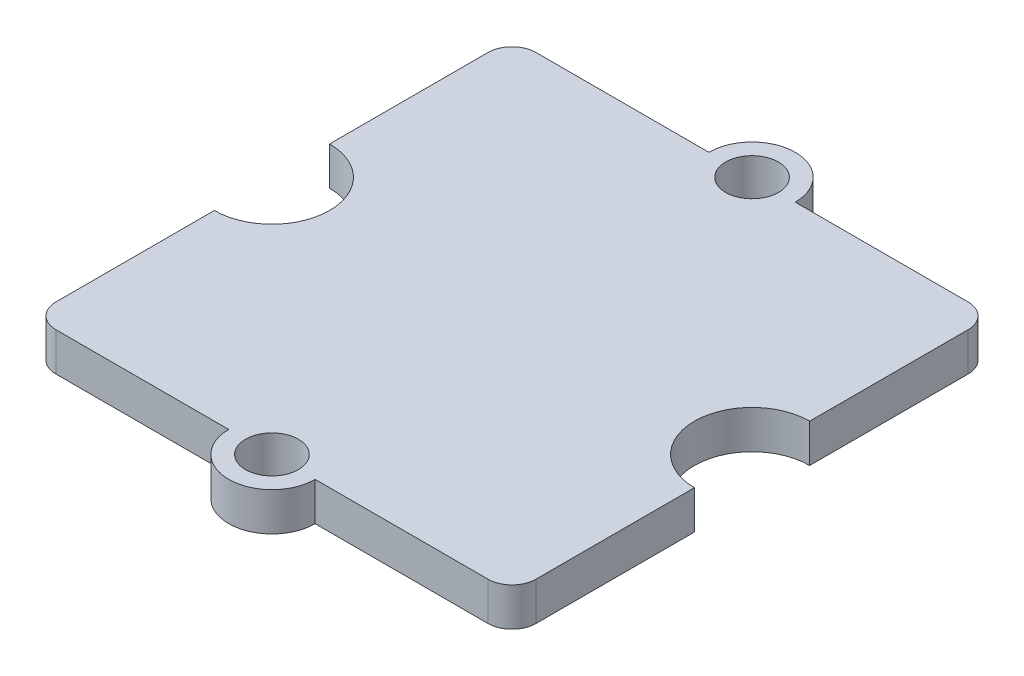
ISO-10303-21;
HEADER;
FILE_DESCRIPTION(('STEP AP214'),'2;1');
FILE_NAME('part.step','',(''),(''),'','','');
FILE_SCHEMA(('AUTOMOTIVE_DESIGN { 1 0 10303 214 1 1 1 1 }'));
ENDSEC;
DATA;
#1=APPLICATION_CONTEXT('core data for automotive mechanical design processes');
#2=APPLICATION_PROTOCOL_DEFINITION('international standard','automotive_design',2000,#1);
#3=PRODUCT_CONTEXT('',#1,'mechanical');
#4=PRODUCT('Part','Part','',(#3));
#5=PRODUCT_RELATED_PRODUCT_CATEGORY('part','',(#4));
#6=PRODUCT_DEFINITION_FORMATION('','',#4);
#7=PRODUCT_DEFINITION_CONTEXT('part definition',#1,'design');
#8=PRODUCT_DEFINITION('design','',#6,#7);
#9=PRODUCT_DEFINITION_SHAPE('','',#8);
#10=(LENGTH_UNIT() NAMED_UNIT(*) SI_UNIT(.MILLI.,.METRE.));
#11=(NAMED_UNIT(*) PLANE_ANGLE_UNIT() SI_UNIT($,.RADIAN.));
#12=(NAMED_UNIT(*) SI_UNIT($,.STERADIAN.) SOLID_ANGLE_UNIT());
#13=UNCERTAINTY_MEASURE_WITH_UNIT(LENGTH_MEASURE(1.E-05),#10,'distance_accuracy_value','');
#14=(GEOMETRIC_REPRESENTATION_CONTEXT(3) GLOBAL_UNCERTAINTY_ASSIGNED_CONTEXT((#13)) GLOBAL_UNIT_ASSIGNED_CONTEXT((#10,
#11,#12)) REPRESENTATION_CONTEXT('',''));
#15=CARTESIAN_POINT('',(0.,0.,0.));
#16=DIRECTION('',(0.,0.,1.));
#17=DIRECTION('',(1.,0.,0.));
#18=AXIS2_PLACEMENT_3D('',#15,#16,#17);
#19=CARTESIAN_POINT('',(0.,1.6,10.));
#20=DIRECTION('',(0.,-1.,0.));
#21=DIRECTION('',(0.,0.,-1.));
#22=AXIS2_PLACEMENT_3D('',#19,#20,#21);
#23=CYLINDRICAL_SURFACE('',#22,1.8);
#24=CARTESIAN_POINT('',(0.,0.,10.));
#25=DIRECTION('',(0.,1.,0.));
#26=DIRECTION('',(0.,0.,1.));
#27=AXIS2_PLACEMENT_3D('',#24,#25,#26);
#28=CIRCLE('',#27,1.8);
#29=CARTESIAN_POINT('',(-1.8,0.,10.));
#30=VERTEX_POINT('',#29);
#31=CARTESIAN_POINT('',(1.8,0.,10.));
#32=VERTEX_POINT('',#31);
#33=EDGE_CURVE('E185',#30,#32,#28,.T.);
#34=ORIENTED_EDGE('',*,*,#33,.T.);
#35=DIRECTION('',(0.,-1.,0.));
#36=VECTOR('',#35,1.);
#37=CARTESIAN_POINT('',(1.8,1.6,10.));
#38=LINE('',#37,#36);
#39=CARTESIAN_POINT('',(1.8,1.6,10.));
#40=VERTEX_POINT('',#39);
#41=EDGE_CURVE('E11',#40,#32,#38,.T.);
#42=ORIENTED_EDGE('',*,*,#41,.F.);
#43=CARTESIAN_POINT('',(0.,1.6,10.));
#44=DIRECTION('',(0.,1.,0.));
#45=DIRECTION('',(0.,0.,1.));
#46=AXIS2_PLACEMENT_3D('',#43,#44,#45);
#47=CIRCLE('',#46,1.8);
#48=CARTESIAN_POINT('',(-1.8,1.6,10.));
#49=VERTEX_POINT('',#48);
#50=EDGE_CURVE('E226',#49,#40,#47,.T.);
#51=ORIENTED_EDGE('',*,*,#50,.F.);
#52=DIRECTION('',(0.,-1.,0.));
#53=VECTOR('',#52,1.);
#54=CARTESIAN_POINT('',(-1.8,1.6,10.));
#55=LINE('',#54,#53);
#56=EDGE_CURVE('E184',#49,#30,#55,.T.);
#57=ORIENTED_EDGE('',*,*,#56,.T.);
#58=EDGE_LOOP('',(#34,#42,#51,#57));
#59=FACE_BOUND('',#58,.T.);
#60=ADVANCED_FACE('F34',(#59),#23,.T.);
#61=CARTESIAN_POINT('',(0.,1.6,10.));
#62=DIRECTION('',(0.,0.,-1.));
#63=DIRECTION('',(-1.,0.,0.));
#64=AXIS2_PLACEMENT_3D('',#61,#62,#63);
#65=PLANE('',#64);
#66=DIRECTION('',(1.,0.,0.));
#67=VECTOR('',#66,1.);
#68=CARTESIAN_POINT('',(0.,0.,10.));
#69=LINE('',#68,#67);
#70=CARTESIAN_POINT('',(8.99999999999999,0.,10.));
#71=VERTEX_POINT('',#70);
#72=EDGE_CURVE('E188',#32,#71,#69,.T.);
#73=ORIENTED_EDGE('',*,*,#72,.T.);
#74=DIRECTION('',(0.,-1.,0.));
#75=VECTOR('',#74,1.);
#76=CARTESIAN_POINT('',(8.99999999999999,1.6,10.));
#77=LINE('',#76,#75);
#78=CARTESIAN_POINT('',(8.99999999999999,1.6,10.));
#79=VERTEX_POINT('',#78);
#80=EDGE_CURVE('E42',#79,#71,#77,.T.);
#81=ORIENTED_EDGE('',*,*,#80,.F.);
#82=DIRECTION('',(1.,0.,0.));
#83=VECTOR('',#82,1.);
#84=CARTESIAN_POINT('',(0.,1.6,10.));
#85=LINE('',#84,#83);
#86=EDGE_CURVE('E113',#40,#79,#85,.T.);
#87=ORIENTED_EDGE('',*,*,#86,.F.);
#88=ORIENTED_EDGE('',*,*,#41,.T.);
#89=EDGE_LOOP('',(#73,#81,#87,#88));
#90=FACE_BOUND('',#89,.T.);
#91=ADVANCED_FACE('F306',(#90),#65,.F.);
#92=CARTESIAN_POINT('',(9.,1.6,9.00000000000001));
#93=DIRECTION('',(0.,-1.,0.));
#94=DIRECTION('',(0.,0.,-1.));
#95=AXIS2_PLACEMENT_3D('',#92,#93,#94);
#96=CYLINDRICAL_SURFACE('',#95,1.);
#97=CARTESIAN_POINT('',(9.,0.,9.00000000000001));
#98=DIRECTION('',(0.,1.,0.));
#99=DIRECTION('',(0.,0.,1.));
#100=AXIS2_PLACEMENT_3D('',#97,#98,#99);
#101=CIRCLE('',#100,1.);
#102=CARTESIAN_POINT('',(10.,0.,9.));
#103=VERTEX_POINT('',#102);
#104=EDGE_CURVE('E190',#71,#103,#101,.T.);
#105=ORIENTED_EDGE('',*,*,#104,.T.);
#106=DIRECTION('',(0.,-1.,0.));
#107=VECTOR('',#106,1.);
#108=CARTESIAN_POINT('',(10.,1.6,9.));
#109=LINE('',#108,#107);
#110=CARTESIAN_POINT('',(10.,1.6,9.));
#111=VERTEX_POINT('',#110);
#112=EDGE_CURVE('E248',#111,#103,#109,.T.);
#113=ORIENTED_EDGE('',*,*,#112,.F.);
#114=CARTESIAN_POINT('',(9.,1.6,9.00000000000001));
#115=DIRECTION('',(0.,1.,0.));
#116=DIRECTION('',(0.,0.,1.));
#117=AXIS2_PLACEMENT_3D('',#114,#115,#116);
#118=CIRCLE('',#117,1.);
#119=EDGE_CURVE('E256',#79,#111,#118,.T.);
#120=ORIENTED_EDGE('',*,*,#119,.F.);
#121=ORIENTED_EDGE('',*,*,#80,.T.);
#122=EDGE_LOOP('',(#105,#113,#120,#121));
#123=FACE_BOUND('',#122,.T.);
#124=ADVANCED_FACE('F254',(#123),#96,.T.);
#125=CARTESIAN_POINT('',(10.,1.6,0.));
#126=DIRECTION('',(-1.,0.,0.));
#127=DIRECTION('',(0.,0.,1.));
#128=AXIS2_PLACEMENT_3D('',#125,#126,#127);
#129=PLANE('',#128);
#130=DIRECTION('',(0.,0.,-1.));
#131=VECTOR('',#130,1.);
#132=CARTESIAN_POINT('',(10.,0.,0.));
#133=LINE('',#132,#131);
#134=CARTESIAN_POINT('',(10.,0.,2.40000000000001));
#135=VERTEX_POINT('',#134);
#136=EDGE_CURVE('E192',#103,#135,#133,.T.);
#137=ORIENTED_EDGE('',*,*,#136,.T.);
#138=DIRECTION('',(0.,-1.,0.));
#139=VECTOR('',#138,1.);
#140=CARTESIAN_POINT('',(10.,1.6,2.40000000000001));
#141=LINE('',#140,#139);
#142=CARTESIAN_POINT('',(10.,1.6,2.40000000000001));
#143=VERTEX_POINT('',#142);
#144=EDGE_CURVE('E246',#143,#135,#141,.T.);
#145=ORIENTED_EDGE('',*,*,#144,.F.);
#146=DIRECTION('',(0.,0.,-1.));
#147=VECTOR('',#146,1.);
#148=CARTESIAN_POINT('',(10.,1.6,0.));
#149=LINE('',#148,#147);
#150=EDGE_CURVE('E269',#111,#143,#149,.T.);
#151=ORIENTED_EDGE('',*,*,#150,.F.);
#152=ORIENTED_EDGE('',*,*,#112,.T.);
#153=EDGE_LOOP('',(#137,#145,#151,#152));
#154=FACE_BOUND('',#153,.T.);
#155=ADVANCED_FACE('F266',(#154),#129,.F.);
#156=CARTESIAN_POINT('',(10.,1.6,0.));
#157=DIRECTION('',(0.,-1.,0.));
#158=DIRECTION('',(0.,0.,-1.));
#159=AXIS2_PLACEMENT_3D('',#156,#157,#158);
#160=CYLINDRICAL_SURFACE('',#159,2.4);
#161=CARTESIAN_POINT('',(10.,0.,0.));
#162=DIRECTION('',(0.,1.,0.));
#163=DIRECTION('',(0.,0.,1.));
#164=AXIS2_PLACEMENT_3D('',#161,#162,#163);
#165=CIRCLE('',#164,2.4);
#166=CARTESIAN_POINT('',(10.,0.,-2.39999999999999));
#167=VERTEX_POINT('',#166);
#168=EDGE_CURVE('E195',#167,#135,#165,.T.);
#169=ORIENTED_EDGE('',*,*,#168,.F.);
#170=DIRECTION('',(0.,-1.,0.));
#171=VECTOR('',#170,1.);
#172=CARTESIAN_POINT('',(10.,1.6,-2.39999999999999));
#173=LINE('',#172,#171);
#174=CARTESIAN_POINT('',(10.,1.6,-2.39999999999999));
#175=VERTEX_POINT('',#174);
#176=EDGE_CURVE('E244',#175,#167,#173,.T.);
#177=ORIENTED_EDGE('',*,*,#176,.F.);
#178=CARTESIAN_POINT('',(10.,1.6,0.));
#179=DIRECTION('',(0.,1.,0.));
#180=DIRECTION('',(0.,0.,1.));
#181=AXIS2_PLACEMENT_3D('',#178,#179,#180);
#182=CIRCLE('',#181,2.4);
#183=EDGE_CURVE('E271',#175,#143,#182,.T.);
#184=ORIENTED_EDGE('',*,*,#183,.T.);
#185=ORIENTED_EDGE('',*,*,#144,.T.);
#186=EDGE_LOOP('',(#169,#177,#184,#185));
#187=FACE_BOUND('',#186,.T.);
#188=ADVANCED_FACE('F335',(#187),#160,.F.);
#189=CARTESIAN_POINT('',(10.,0.,-8.99999999999999));
#190=VERTEX_POINT('',#189);
#191=EDGE_CURVE('E196',#167,#190,#133,.T.);
#192=ORIENTED_EDGE('',*,*,#191,.T.);
#193=DIRECTION('',(0.,-1.,0.));
#194=VECTOR('',#193,1.);
#195=CARTESIAN_POINT('',(10.,1.6,-8.99999999999999));
#196=LINE('',#195,#194);
#197=CARTESIAN_POINT('',(10.,1.6,-8.99999999999999));
#198=VERTEX_POINT('',#197);
#199=EDGE_CURVE('E242',#198,#190,#196,.T.);
#200=ORIENTED_EDGE('',*,*,#199,.F.);
#201=EDGE_CURVE('E273',#175,#198,#149,.T.);
#202=ORIENTED_EDGE('',*,*,#201,.F.);
#203=ORIENTED_EDGE('',*,*,#176,.T.);
#204=EDGE_LOOP('',(#192,#200,#202,#203));
#205=FACE_BOUND('',#204,.T.);
#206=ADVANCED_FACE('F337',(#205),#129,.F.);
#207=CARTESIAN_POINT('',(9.,1.6,-8.99999999999999));
#208=DIRECTION('',(0.,-1.,0.));
#209=DIRECTION('',(0.,0.,-1.));
#210=AXIS2_PLACEMENT_3D('',#207,#208,#209);
#211=CYLINDRICAL_SURFACE('',#210,1.);
#212=CARTESIAN_POINT('',(9.,0.,-8.99999999999999));
#213=DIRECTION('',(0.,1.,0.));
#214=DIRECTION('',(0.,0.,1.));
#215=AXIS2_PLACEMENT_3D('',#212,#213,#214);
#216=CIRCLE('',#215,1.);
#217=CARTESIAN_POINT('',(8.99999999999999,0.,-9.99999999999999));
#218=VERTEX_POINT('',#217);
#219=EDGE_CURVE('E199',#218,#190,#216,.F.);
#220=ORIENTED_EDGE('',*,*,#219,.F.);
#221=DIRECTION('',(0.,-1.,0.));
#222=VECTOR('',#221,1.);
#223=CARTESIAN_POINT('',(8.99999999999999,1.6,-9.99999999999999));
#224=LINE('',#223,#222);
#225=CARTESIAN_POINT('',(8.99999999999999,1.6,-9.99999999999999));
#226=VERTEX_POINT('',#225);
#227=EDGE_CURVE('E240',#226,#218,#224,.T.);
#228=ORIENTED_EDGE('',*,*,#227,.F.);
#229=CARTESIAN_POINT('',(9.,1.6,-8.99999999999999));
#230=DIRECTION('',(0.,1.,0.));
#231=DIRECTION('',(0.,0.,1.));
#232=AXIS2_PLACEMENT_3D('',#229,#230,#231);
#233=CIRCLE('',#232,1.);
#234=EDGE_CURVE('E276',#226,#198,#233,.F.);
#235=ORIENTED_EDGE('',*,*,#234,.T.);
#236=ORIENTED_EDGE('',*,*,#199,.T.);
#237=EDGE_LOOP('',(#220,#228,#235,#236));
#238=FACE_BOUND('',#237,.T.);
#239=ADVANCED_FACE('F350',(#238),#211,.T.);
#240=CARTESIAN_POINT('',(0.,1.6,-9.99999999999999));
#241=DIRECTION('',(0.,0.,-1.));
#242=DIRECTION('',(-1.,0.,0.));
#243=AXIS2_PLACEMENT_3D('',#240,#241,#242);
#244=PLANE('',#243);
#245=DIRECTION('',(1.,0.,0.));
#246=VECTOR('',#245,1.);
#247=CARTESIAN_POINT('',(0.,0.,-9.99999999999999));
#248=LINE('',#247,#246);
#249=CARTESIAN_POINT('',(1.8,0.,-9.99999999999999));
#250=VERTEX_POINT('',#249);
#251=EDGE_CURVE('E202',#250,#218,#248,.T.);
#252=ORIENTED_EDGE('',*,*,#251,.F.);
#253=DIRECTION('',(0.,-1.,0.));
#254=VECTOR('',#253,1.);
#255=CARTESIAN_POINT('',(1.8,1.6,-9.99999999999999));
#256=LINE('',#255,#254);
#257=CARTESIAN_POINT('',(1.8,1.6,-9.99999999999999));
#258=VERTEX_POINT('',#257);
#259=EDGE_CURVE('E238',#258,#250,#256,.T.);
#260=ORIENTED_EDGE('',*,*,#259,.F.);
#261=DIRECTION('',(1.,0.,0.));
#262=VECTOR('',#261,1.);
#263=CARTESIAN_POINT('',(0.,1.6,-9.99999999999999));
#264=LINE('',#263,#262);
#265=EDGE_CURVE('E281',#258,#226,#264,.T.);
#266=ORIENTED_EDGE('',*,*,#265,.T.);
#267=ORIENTED_EDGE('',*,*,#227,.T.);
#268=EDGE_LOOP('',(#252,#260,#266,#267));
#269=FACE_BOUND('',#268,.T.);
#270=ADVANCED_FACE('F357',(#269),#244,.T.);
#271=CARTESIAN_POINT('',(0.,1.6,-9.99999999999999));
#272=DIRECTION('',(0.,-1.,0.));
#273=DIRECTION('',(0.,0.,-1.));
#274=AXIS2_PLACEMENT_3D('',#271,#272,#273);
#275=CYLINDRICAL_SURFACE('',#274,1.8);
#276=CARTESIAN_POINT('',(0.,0.,-9.99999999999999));
#277=DIRECTION('',(0.,1.,0.));
#278=DIRECTION('',(0.,0.,1.));
#279=AXIS2_PLACEMENT_3D('',#276,#277,#278);
#280=CIRCLE('',#279,1.8);
#281=CARTESIAN_POINT('',(-1.8,0.,-9.99999999999999));
#282=VERTEX_POINT('',#281);
#283=EDGE_CURVE('E205',#250,#282,#280,.T.);
#284=ORIENTED_EDGE('',*,*,#283,.T.);
#285=DIRECTION('',(0.,-1.,0.));
#286=VECTOR('',#285,1.);
#287=CARTESIAN_POINT('',(-1.8,1.6,-9.99999999999999));
#288=LINE('',#287,#286);
#289=CARTESIAN_POINT('',(-1.8,1.6,-9.99999999999999));
#290=VERTEX_POINT('',#289);
#291=EDGE_CURVE('E236',#290,#282,#288,.T.);
#292=ORIENTED_EDGE('',*,*,#291,.F.);
#293=CARTESIAN_POINT('',(0.,1.6,-9.99999999999999));
#294=DIRECTION('',(0.,1.,0.));
#295=DIRECTION('',(0.,0.,1.));
#296=AXIS2_PLACEMENT_3D('',#293,#294,#295);
#297=CIRCLE('',#296,1.8);
#298=EDGE_CURVE('E285',#258,#290,#297,.T.);
#299=ORIENTED_EDGE('',*,*,#298,.F.);
#300=ORIENTED_EDGE('',*,*,#259,.T.);
#301=EDGE_LOOP('',(#284,#292,#299,#300));
#302=FACE_BOUND('',#301,.T.);
#303=ADVANCED_FACE('F364',(#302),#275,.T.);
#304=CARTESIAN_POINT('',(-8.99999999999999,0.,-9.99999999999999));
#305=VERTEX_POINT('',#304);
#306=EDGE_CURVE('E206',#305,#282,#248,.T.);
#307=ORIENTED_EDGE('',*,*,#306,.F.);
#308=DIRECTION('',(0.,-1.,0.));
#309=VECTOR('',#308,1.);
#310=CARTESIAN_POINT('',(-8.99999999999999,1.6,-9.99999999999999));
#311=LINE('',#310,#309);
#312=CARTESIAN_POINT('',(-8.99999999999999,1.6,-9.99999999999999));
#313=VERTEX_POINT('',#312);
#314=EDGE_CURVE('E234',#313,#305,#311,.T.);
#315=ORIENTED_EDGE('',*,*,#314,.F.);
#316=EDGE_CURVE('E287',#313,#290,#264,.T.);
#317=ORIENTED_EDGE('',*,*,#316,.T.);
#318=ORIENTED_EDGE('',*,*,#291,.T.);
#319=EDGE_LOOP('',(#307,#315,#317,#318));
#320=FACE_BOUND('',#319,.T.);
#321=ADVANCED_FACE('F367',(#320),#244,.T.);
#322=CARTESIAN_POINT('',(-9.,1.6,-8.99999999999999));
#323=DIRECTION('',(0.,-1.,0.));
#324=DIRECTION('',(0.,0.,-1.));
#325=AXIS2_PLACEMENT_3D('',#322,#323,#324);
#326=CYLINDRICAL_SURFACE('',#325,1.);
#327=CARTESIAN_POINT('',(-9.,0.,-8.99999999999999));
#328=DIRECTION('',(0.,1.,0.));
#329=DIRECTION('',(0.,0.,1.));
#330=AXIS2_PLACEMENT_3D('',#327,#328,#329);
#331=CIRCLE('',#330,1.);
#332=CARTESIAN_POINT('',(-10.,0.,-8.99999999999999));
#333=VERTEX_POINT('',#332);
#334=EDGE_CURVE('E209',#333,#305,#331,.F.);
#335=ORIENTED_EDGE('',*,*,#334,.F.);
#336=DIRECTION('',(0.,-1.,0.));
#337=VECTOR('',#336,1.);
#338=CARTESIAN_POINT('',(-10.,1.6,-8.99999999999999));
#339=LINE('',#338,#337);
#340=CARTESIAN_POINT('',(-10.,1.6,-8.99999999999999));
#341=VERTEX_POINT('',#340);
#342=EDGE_CURVE('E232',#341,#333,#339,.T.);
#343=ORIENTED_EDGE('',*,*,#342,.F.);
#344=CARTESIAN_POINT('',(-9.,1.6,-8.99999999999999));
#345=DIRECTION('',(0.,1.,0.));
#346=DIRECTION('',(0.,0.,1.));
#347=AXIS2_PLACEMENT_3D('',#344,#345,#346);
#348=CIRCLE('',#347,1.);
#349=EDGE_CURVE('E290',#341,#313,#348,.F.);
#350=ORIENTED_EDGE('',*,*,#349,.T.);
#351=ORIENTED_EDGE('',*,*,#314,.T.);
#352=EDGE_LOOP('',(#335,#343,#350,#351));
#353=FACE_BOUND('',#352,.T.);
#354=ADVANCED_FACE('F380',(#353),#326,.T.);
#355=CARTESIAN_POINT('',(-10.,1.6,0.));
#356=DIRECTION('',(-1.,0.,0.));
#357=DIRECTION('',(0.,0.,1.));
#358=AXIS2_PLACEMENT_3D('',#355,#356,#357);
#359=PLANE('',#358);
#360=DIRECTION('',(0.,0.,-1.));
#361=VECTOR('',#360,1.);
#362=CARTESIAN_POINT('',(-10.,0.,0.));
#363=LINE('',#362,#361);
#364=CARTESIAN_POINT('',(-10.,0.,-2.39999999999999));
#365=VERTEX_POINT('',#364);
#366=EDGE_CURVE('E212',#365,#333,#363,.T.);
#367=ORIENTED_EDGE('',*,*,#366,.F.);
#368=DIRECTION('',(0.,-1.,0.));
#369=VECTOR('',#368,1.);
#370=CARTESIAN_POINT('',(-10.,1.6,-2.39999999999999));
#371=LINE('',#370,#369);
#372=CARTESIAN_POINT('',(-10.,1.6,-2.39999999999999));
#373=VERTEX_POINT('',#372);
#374=EDGE_CURVE('E230',#373,#365,#371,.T.);
#375=ORIENTED_EDGE('',*,*,#374,.F.);
#376=DIRECTION('',(0.,0.,-1.));
#377=VECTOR('',#376,1.);
#378=CARTESIAN_POINT('',(-10.,1.6,0.));
#379=LINE('',#378,#377);
#380=EDGE_CURVE('E172',#373,#341,#379,.T.);
#381=ORIENTED_EDGE('',*,*,#380,.T.);
#382=ORIENTED_EDGE('',*,*,#342,.T.);
#383=EDGE_LOOP('',(#367,#375,#381,#382));
#384=FACE_BOUND('',#383,.T.);
#385=ADVANCED_FACE('F387',(#384),#359,.T.);
#386=CARTESIAN_POINT('',(-10.,1.6,0.));
#387=DIRECTION('',(0.,-1.,0.));
#388=DIRECTION('',(0.,0.,-1.));
#389=AXIS2_PLACEMENT_3D('',#386,#387,#388);
#390=CYLINDRICAL_SURFACE('',#389,2.4);
#391=CARTESIAN_POINT('',(-10.,0.,0.));
#392=DIRECTION('',(0.,1.,0.));
#393=DIRECTION('',(0.,0.,1.));
#394=AXIS2_PLACEMENT_3D('',#391,#392,#393);
#395=CIRCLE('',#394,2.4);
#396=CARTESIAN_POINT('',(-10.,0.,2.40000000000001));
#397=VERTEX_POINT('',#396);
#398=EDGE_CURVE('E215',#397,#365,#395,.T.);
#399=ORIENTED_EDGE('',*,*,#398,.F.);
#400=DIRECTION('',(0.,-1.,0.));
#401=VECTOR('',#400,1.);
#402=CARTESIAN_POINT('',(-10.,1.6,2.40000000000001));
#403=LINE('',#402,#401);
#404=CARTESIAN_POINT('',(-10.,1.6,2.40000000000001));
#405=VERTEX_POINT('',#404);
#406=EDGE_CURVE('E162',#405,#397,#403,.T.);
#407=ORIENTED_EDGE('',*,*,#406,.F.);
#408=CARTESIAN_POINT('',(-10.,1.6,0.));
#409=DIRECTION('',(0.,1.,0.));
#410=DIRECTION('',(0.,0.,1.));
#411=AXIS2_PLACEMENT_3D('',#408,#409,#410);
#412=CIRCLE('',#411,2.4);
#413=EDGE_CURVE('E170',#405,#373,#412,.T.);
#414=ORIENTED_EDGE('',*,*,#413,.T.);
#415=ORIENTED_EDGE('',*,*,#374,.T.);
#416=EDGE_LOOP('',(#399,#407,#414,#415));
#417=FACE_BOUND('',#416,.T.);
#418=ADVANCED_FACE('F296',(#417),#390,.F.);
#419=CARTESIAN_POINT('',(-10.,0.,9.));
#420=VERTEX_POINT('',#419);
#421=EDGE_CURVE('E157',#420,#397,#363,.T.);
#422=ORIENTED_EDGE('',*,*,#421,.F.);
#423=DIRECTION('',(0.,-1.,0.));
#424=VECTOR('',#423,1.);
#425=CARTESIAN_POINT('',(-10.,1.6,9.));
#426=LINE('',#425,#424);
#427=CARTESIAN_POINT('',(-10.,1.6,9.));
#428=VERTEX_POINT('',#427);
#429=EDGE_CURVE('E152',#428,#420,#426,.T.);
#430=ORIENTED_EDGE('',*,*,#429,.F.);
#431=EDGE_CURVE('E155',#428,#405,#379,.T.);
#432=ORIENTED_EDGE('',*,*,#431,.T.);
#433=ORIENTED_EDGE('',*,*,#406,.T.);
#434=EDGE_LOOP('',(#422,#430,#432,#433));
#435=FACE_BOUND('',#434,.T.);
#436=ADVANCED_FACE('F154',(#435),#359,.T.);
#437=CARTESIAN_POINT('',(-9.,1.6,9.00000000000001));
#438=DIRECTION('',(0.,-1.,0.));
#439=DIRECTION('',(0.,0.,-1.));
#440=AXIS2_PLACEMENT_3D('',#437,#438,#439);
#441=CYLINDRICAL_SURFACE('',#440,1.);
#442=CARTESIAN_POINT('',(-9.,0.,9.00000000000001));
#443=DIRECTION('',(0.,1.,0.));
#444=DIRECTION('',(0.,0.,1.));
#445=AXIS2_PLACEMENT_3D('',#442,#443,#444);
#446=CIRCLE('',#445,1.);
#447=CARTESIAN_POINT('',(-8.99999999999999,0.,10.));
#448=VERTEX_POINT('',#447);
#449=EDGE_CURVE('E218',#448,#420,#446,.F.);
#450=ORIENTED_EDGE('',*,*,#449,.F.);
#451=DIRECTION('',(0.,-1.,0.));
#452=VECTOR('',#451,1.);
#453=CARTESIAN_POINT('',(-8.99999999999999,1.6,10.));
#454=LINE('',#453,#452);
#455=CARTESIAN_POINT('',(-8.99999999999999,1.6,10.));
#456=VERTEX_POINT('',#455);
#457=EDGE_CURVE('E102',#456,#448,#454,.T.);
#458=ORIENTED_EDGE('',*,*,#457,.F.);
#459=CARTESIAN_POINT('',(-9.,1.6,9.00000000000001));
#460=DIRECTION('',(0.,1.,0.));
#461=DIRECTION('',(0.,0.,1.));
#462=AXIS2_PLACEMENT_3D('',#459,#460,#461);
#463=CIRCLE('',#462,1.);
#464=EDGE_CURVE('E167',#456,#428,#463,.F.);
#465=ORIENTED_EDGE('',*,*,#464,.T.);
#466=ORIENTED_EDGE('',*,*,#429,.T.);
#467=EDGE_LOOP('',(#450,#458,#465,#466));
#468=FACE_BOUND('',#467,.T.);
#469=ADVANCED_FACE('F173',(#468),#441,.T.);
#470=CARTESIAN_POINT('',(0.,1.6,-9.99999999999999));
#471=DIRECTION('',(0.,-1.,0.));
#472=DIRECTION('',(0.,0.,-1.));
#473=AXIS2_PLACEMENT_3D('',#470,#471,#472);
#474=CYLINDRICAL_SURFACE('',#473,1.1);
#475=CARTESIAN_POINT('',(0.,1.6,-9.99999999999999));
#476=DIRECTION('',(0.,1.,0.));
#477=DIRECTION('',(0.,0.,1.));
#478=AXIS2_PLACEMENT_3D('',#475,#476,#477);
#479=CIRCLE('',#478,1.1);
#480=CARTESIAN_POINT('',(0.,1.6,-8.9));
#481=VERTEX_POINT('',#480);
#482=EDGE_CURVE('E175',#481,#481,#479,.T.);
#483=ORIENTED_EDGE('',*,*,#482,.T.);
#484=EDGE_LOOP('',(#483));
#485=FACE_BOUND('',#484,.T.);
#486=CARTESIAN_POINT('',(0.,0.,-9.99999999999999));
#487=DIRECTION('',(0.,1.,0.));
#488=DIRECTION('',(0.,0.,1.));
#489=AXIS2_PLACEMENT_3D('',#486,#487,#488);
#490=CIRCLE('',#489,1.1);
#491=CARTESIAN_POINT('',(0.,0.,-8.9));
#492=VERTEX_POINT('',#491);
#493=EDGE_CURVE('E220',#492,#492,#490,.T.);
#494=ORIENTED_EDGE('',*,*,#493,.F.);
#495=EDGE_LOOP('',(#494));
#496=FACE_BOUND('',#495,.T.);
#497=ADVANCED_FACE('F304',(#485,#496),#474,.F.);
#498=EDGE_CURVE('E105',#448,#30,#69,.T.);
#499=ORIENTED_EDGE('',*,*,#498,.T.);
#500=ORIENTED_EDGE('',*,*,#56,.F.);
#501=EDGE_CURVE('E50',#456,#49,#85,.T.);
#502=ORIENTED_EDGE('',*,*,#501,.F.);
#503=ORIENTED_EDGE('',*,*,#457,.T.);
#504=EDGE_LOOP('',(#499,#500,#502,#503));
#505=FACE_BOUND('',#504,.T.);
#506=ADVANCED_FACE('F301',(#505),#65,.F.);
#507=CARTESIAN_POINT('',(0.,1.6,10.));
#508=DIRECTION('',(0.,-1.,0.));
#509=DIRECTION('',(0.,0.,-1.));
#510=AXIS2_PLACEMENT_3D('',#507,#508,#509);
#511=CYLINDRICAL_SURFACE('',#510,1.1);
#512=CARTESIAN_POINT('',(0.,1.6,10.));
#513=DIRECTION('',(0.,1.,0.));
#514=DIRECTION('',(0.,0.,1.));
#515=AXIS2_PLACEMENT_3D('',#512,#513,#514);
#516=CIRCLE('',#515,1.1);
#517=CARTESIAN_POINT('',(0.,1.6,11.1));
#518=VERTEX_POINT('',#517);
#519=EDGE_CURVE('E181',#518,#518,#516,.T.);
#520=ORIENTED_EDGE('',*,*,#519,.T.);
#521=EDGE_LOOP('',(#520));
#522=FACE_BOUND('',#521,.T.);
#523=CARTESIAN_POINT('',(0.,0.,10.));
#524=DIRECTION('',(0.,1.,0.));
#525=DIRECTION('',(0.,0.,1.));
#526=AXIS2_PLACEMENT_3D('',#523,#524,#525);
#527=CIRCLE('',#526,1.1);
#528=CARTESIAN_POINT('',(0.,0.,11.1));
#529=VERTEX_POINT('',#528);
#530=EDGE_CURVE('E223',#529,#529,#527,.T.);
#531=ORIENTED_EDGE('',*,*,#530,.F.);
#532=EDGE_LOOP('',(#531));
#533=FACE_BOUND('',#532,.T.);
#534=ADVANCED_FACE('F303',(#522,#533),#511,.F.);
#535=CARTESIAN_POINT('',(0.,1.6,0.));
#536=DIRECTION('',(0.,1.,0.));
#537=DIRECTION('',(0.,0.,1.));
#538=AXIS2_PLACEMENT_3D('',#535,#536,#537);
#539=PLANE('',#538);
#540=ORIENTED_EDGE('',*,*,#50,.T.);
#541=ORIENTED_EDGE('',*,*,#86,.T.);
#542=ORIENTED_EDGE('',*,*,#119,.T.);
#543=ORIENTED_EDGE('',*,*,#150,.T.);
#544=ORIENTED_EDGE('',*,*,#183,.F.);
#545=ORIENTED_EDGE('',*,*,#201,.T.);
#546=ORIENTED_EDGE('',*,*,#234,.F.);
#547=ORIENTED_EDGE('',*,*,#265,.F.);
#548=ORIENTED_EDGE('',*,*,#298,.T.);
#549=ORIENTED_EDGE('',*,*,#316,.F.);
#550=ORIENTED_EDGE('',*,*,#349,.F.);
#551=ORIENTED_EDGE('',*,*,#380,.F.);
#552=ORIENTED_EDGE('',*,*,#413,.F.);
#553=ORIENTED_EDGE('',*,*,#431,.F.);
#554=ORIENTED_EDGE('',*,*,#464,.F.);
#555=ORIENTED_EDGE('',*,*,#501,.T.);
#556=EDGE_LOOP('',(#540,#541,#542,#543,#544,#545,#546,#547,#548,#549,#550,#551,#552,#553,#554,#555));
#557=FACE_BOUND('',#556,.T.);
#558=ORIENTED_EDGE('',*,*,#482,.F.);
#559=EDGE_LOOP('',(#558));
#560=FACE_BOUND('',#559,.T.);
#561=ORIENTED_EDGE('',*,*,#519,.F.);
#562=EDGE_LOOP('',(#561));
#563=FACE_BOUND('',#562,.T.);
#564=ADVANCED_FACE('F165',(#557,#560,#563),#539,.T.);
#565=CARTESIAN_POINT('',(0.,0.,0.));
#566=DIRECTION('',(0.,1.,0.));
#567=DIRECTION('',(0.,0.,1.));
#568=AXIS2_PLACEMENT_3D('',#565,#566,#567);
#569=PLANE('',#568);
#570=ORIENTED_EDGE('',*,*,#33,.F.);
#571=ORIENTED_EDGE('',*,*,#498,.F.);
#572=ORIENTED_EDGE('',*,*,#449,.T.);
#573=ORIENTED_EDGE('',*,*,#421,.T.);
#574=ORIENTED_EDGE('',*,*,#398,.T.);
#575=ORIENTED_EDGE('',*,*,#366,.T.);
#576=ORIENTED_EDGE('',*,*,#334,.T.);
#577=ORIENTED_EDGE('',*,*,#306,.T.);
#578=ORIENTED_EDGE('',*,*,#283,.F.);
#579=ORIENTED_EDGE('',*,*,#251,.T.);
#580=ORIENTED_EDGE('',*,*,#219,.T.);
#581=ORIENTED_EDGE('',*,*,#191,.F.);
#582=ORIENTED_EDGE('',*,*,#168,.T.);
#583=ORIENTED_EDGE('',*,*,#136,.F.);
#584=ORIENTED_EDGE('',*,*,#104,.F.);
#585=ORIENTED_EDGE('',*,*,#72,.F.);
#586=EDGE_LOOP('',(#570,#571,#572,#573,#574,#575,#576,#577,#578,#579,#580,#581,#582,#583,#584,#585));
#587=FACE_BOUND('',#586,.T.);
#588=ORIENTED_EDGE('',*,*,#493,.T.);
#589=EDGE_LOOP('',(#588));
#590=FACE_BOUND('',#589,.T.);
#591=ORIENTED_EDGE('',*,*,#530,.T.);
#592=EDGE_LOOP('',(#591));
#593=FACE_BOUND('',#592,.T.);
#594=ADVANCED_FACE('F260',(#587,#590,#593),#569,.F.);
#595=CLOSED_SHELL('',(#60,#91,#124,#155,#188,#206,#239,#270,#303,#321,#354,#385,#418,#436,#469,
#497,#506,#534,#564,#594));
#596=MANIFOLD_SOLID_BREP('B2',#595);
#597=ADVANCED_BREP_SHAPE_REPRESENTATION('',(#18,#596),#14);
#598=SHAPE_DEFINITION_REPRESENTATION(#9,#597);
ENDSEC;
END-ISO-10303-21;
